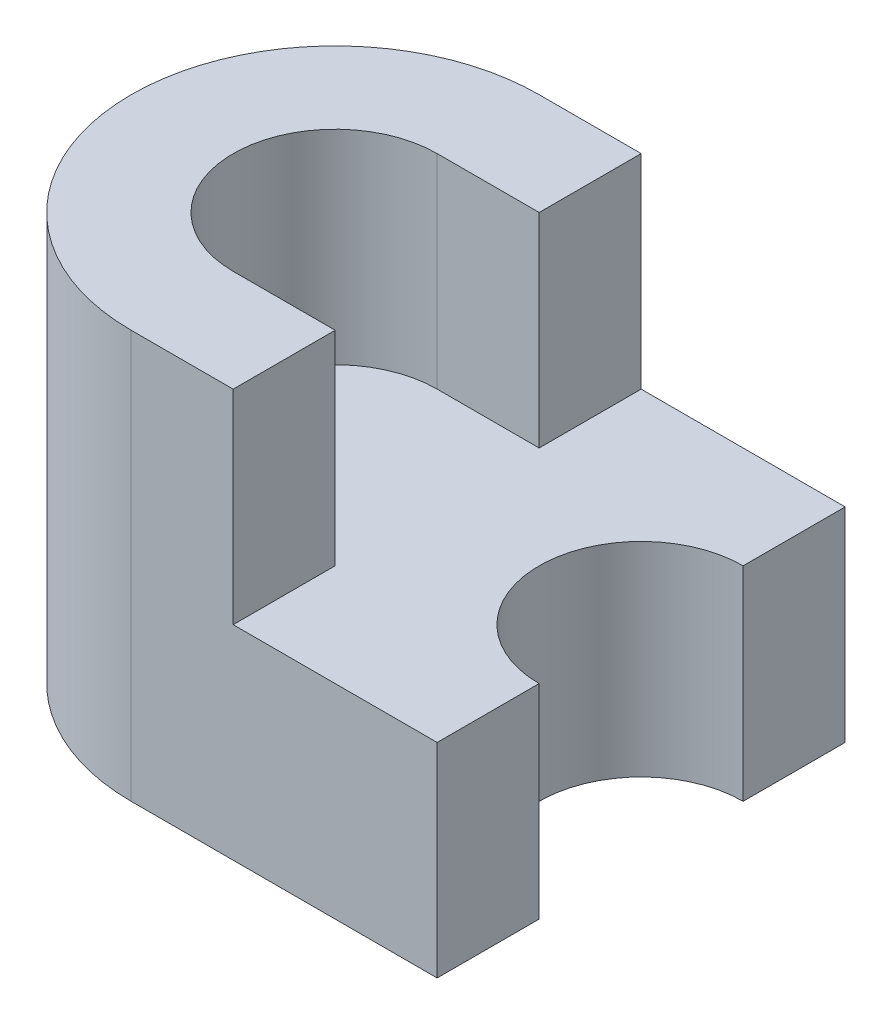
ISO-10303-21;
HEADER;
FILE_DESCRIPTION(('STEP AP214'),'2;1');
FILE_NAME('part.step','',(''),(''),'','','');
FILE_SCHEMA(('AUTOMOTIVE_DESIGN { 1 0 10303 214 1 1 1 1 }'));
ENDSEC;
DATA;
#1=APPLICATION_CONTEXT('core data for automotive mechanical design processes');
#2=APPLICATION_PROTOCOL_DEFINITION('international standard','automotive_design',2000,#1);
#3=PRODUCT_CONTEXT('',#1,'mechanical');
#4=PRODUCT('Part','Part','',(#3));
#5=PRODUCT_RELATED_PRODUCT_CATEGORY('part','',(#4));
#6=PRODUCT_DEFINITION_FORMATION('','',#4);
#7=PRODUCT_DEFINITION_CONTEXT('part definition',#1,'design');
#8=PRODUCT_DEFINITION('design','',#6,#7);
#9=PRODUCT_DEFINITION_SHAPE('','',#8);
#10=(LENGTH_UNIT() NAMED_UNIT(*) SI_UNIT(.MILLI.,.METRE.));
#11=(NAMED_UNIT(*) PLANE_ANGLE_UNIT() SI_UNIT($,.RADIAN.));
#12=(NAMED_UNIT(*) SI_UNIT($,.STERADIAN.) SOLID_ANGLE_UNIT());
#13=UNCERTAINTY_MEASURE_WITH_UNIT(LENGTH_MEASURE(1.E-05),#10,'distance_accuracy_value','');
#14=(GEOMETRIC_REPRESENTATION_CONTEXT(3) GLOBAL_UNCERTAINTY_ASSIGNED_CONTEXT((#13)) GLOBAL_UNIT_ASSIGNED_CONTEXT((#10,
#11,#12)) REPRESENTATION_CONTEXT('',''));
#15=CARTESIAN_POINT('',(0.,0.,0.));
#16=DIRECTION('',(0.,0.,1.));
#17=DIRECTION('',(1.,0.,0.));
#18=AXIS2_PLACEMENT_3D('',#15,#16,#17);
#19=CARTESIAN_POINT('',(0.,40.,0.));
#20=DIRECTION('',(0.,-1.,0.));
#21=DIRECTION('',(0.,0.,-1.));
#22=AXIS2_PLACEMENT_3D('',#19,#20,#21);
#23=PLANE('',#22);
#24=DIRECTION('',(-1.,0.,0.));
#25=VECTOR('',#24,1.);
#26=CARTESIAN_POINT('',(0.,40.,-40.));
#27=LINE('',#26,#25);
#28=CARTESIAN_POINT('',(30.0022520563151,40.,-40.));
#29=VERTEX_POINT('',#28);
#30=CARTESIAN_POINT('',(20.,40.,-40.));
#31=VERTEX_POINT('',#30);
#32=EDGE_CURVE('E224',#29,#31,#27,.T.);
#33=ORIENTED_EDGE('',*,*,#32,.T.);
#34=CARTESIAN_POINT('',(20.,40.,-20.));
#35=DIRECTION('',(0.,-1.,0.));
#36=DIRECTION('',(0.,0.,-1.));
#37=AXIS2_PLACEMENT_3D('',#34,#35,#36);
#38=CIRCLE('',#37,20.);
#39=CARTESIAN_POINT('',(0.,40.,-20.));
#40=VERTEX_POINT('',#39);
#41=EDGE_CURVE('E55',#31,#40,#38,.F.);
#42=ORIENTED_EDGE('',*,*,#41,.T.);
#43=CARTESIAN_POINT('',(20.,40.,-20.));
#44=DIRECTION('',(0.,-1.,0.));
#45=DIRECTION('',(0.,0.,-1.));
#46=AXIS2_PLACEMENT_3D('',#43,#44,#45);
#47=CIRCLE('',#46,20.);
#48=CARTESIAN_POINT('',(20.,40.,0.));
#49=VERTEX_POINT('',#48);
#50=EDGE_CURVE('E62',#40,#49,#47,.F.);
#51=ORIENTED_EDGE('',*,*,#50,.T.);
#52=DIRECTION('',(1.,0.,0.));
#53=VECTOR('',#52,1.);
#54=CARTESIAN_POINT('',(0.,40.,0.));
#55=LINE('',#54,#53);
#56=CARTESIAN_POINT('',(30.0022520563151,40.,0.));
#57=VERTEX_POINT('',#56);
#58=EDGE_CURVE('E227',#49,#57,#55,.T.);
#59=ORIENTED_EDGE('',*,*,#58,.T.);
#60=DIRECTION('',(0.,0.,1.));
#61=VECTOR('',#60,1.);
#62=CARTESIAN_POINT('',(30.0022520563151,40.,-40.));
#63=LINE('',#62,#61);
#64=CARTESIAN_POINT('',(30.0022520563151,40.,-10.));
#65=VERTEX_POINT('',#64);
#66=EDGE_CURVE('E143',#65,#57,#63,.T.);
#67=ORIENTED_EDGE('',*,*,#66,.F.);
#68=DIRECTION('',(1.,0.,0.));
#69=VECTOR('',#68,1.);
#70=CARTESIAN_POINT('',(20.0022520563151,40.,-10.));
#71=LINE('',#70,#69);
#72=CARTESIAN_POINT('',(20.0022520563151,40.,-10.));
#73=VERTEX_POINT('',#72);
#74=EDGE_CURVE('E136',#73,#65,#71,.T.);
#75=ORIENTED_EDGE('',*,*,#74,.F.);
#76=CARTESIAN_POINT('',(20.0022520563151,40.,-20.));
#77=DIRECTION('',(0.,-1.,0.));
#78=DIRECTION('',(0.,0.,-1.));
#79=AXIS2_PLACEMENT_3D('',#76,#77,#78);
#80=CIRCLE('',#79,10.);
#81=CARTESIAN_POINT('',(20.0022520563151,40.,-30.));
#82=VERTEX_POINT('',#81);
#83=EDGE_CURVE('E140',#82,#73,#80,.F.);
#84=ORIENTED_EDGE('',*,*,#83,.F.);
#85=DIRECTION('',(-1.,0.,0.));
#86=VECTOR('',#85,1.);
#87=CARTESIAN_POINT('',(20.0022520563151,40.,-30.));
#88=LINE('',#87,#86);
#89=CARTESIAN_POINT('',(30.0022520563151,40.,-30.));
#90=VERTEX_POINT('',#89);
#91=EDGE_CURVE('E148',#90,#82,#88,.T.);
#92=ORIENTED_EDGE('',*,*,#91,.F.);
#93=EDGE_CURVE('E203',#29,#90,#63,.T.);
#94=ORIENTED_EDGE('',*,*,#93,.F.);
#95=EDGE_LOOP('',(#33,#42,#51,#59,#67,#75,#84,#92,#94));
#96=FACE_BOUND('',#95,.T.);
#97=ADVANCED_FACE('F45',(#96),#23,.F.);
#98=CARTESIAN_POINT('',(30.0022520563151,20.,-40.));
#99=DIRECTION('',(-1.,0.,0.));
#100=DIRECTION('',(0.,0.,1.));
#101=AXIS2_PLACEMENT_3D('',#98,#99,#100);
#102=PLANE('',#101);
#103=ORIENTED_EDGE('',*,*,#93,.T.);
#104=DIRECTION('',(0.,1.,0.));
#105=VECTOR('',#104,1.);
#106=CARTESIAN_POINT('',(30.0022520563151,20.,-30.));
#107=LINE('',#106,#105);
#108=CARTESIAN_POINT('',(30.0022520563151,20.,-30.));
#109=VERTEX_POINT('',#108);
#110=EDGE_CURVE('E181',#109,#90,#107,.T.);
#111=ORIENTED_EDGE('',*,*,#110,.F.);
#112=DIRECTION('',(0.,0.,1.));
#113=VECTOR('',#112,1.);
#114=CARTESIAN_POINT('',(30.0022520563151,20.,-40.));
#115=LINE('',#114,#113);
#116=CARTESIAN_POINT('',(30.0022520563151,20.,-40.));
#117=VERTEX_POINT('',#116);
#118=EDGE_CURVE('E195',#117,#109,#115,.T.);
#119=ORIENTED_EDGE('',*,*,#118,.F.);
#120=DIRECTION('',(0.,1.,0.));
#121=VECTOR('',#120,1.);
#122=CARTESIAN_POINT('',(30.0022520563151,20.,-40.));
#123=LINE('',#122,#121);
#124=EDGE_CURVE('E202',#117,#29,#123,.T.);
#125=ORIENTED_EDGE('',*,*,#124,.T.);
#126=EDGE_LOOP('',(#103,#111,#119,#125));
#127=FACE_BOUND('',#126,.T.);
#128=ADVANCED_FACE('F306',(#127),#102,.F.);
#129=CARTESIAN_POINT('',(50.,40.,0.));
#130=DIRECTION('',(-1.,0.,0.));
#131=DIRECTION('',(0.,0.,1.));
#132=AXIS2_PLACEMENT_3D('',#129,#130,#131);
#133=PLANE('',#132);
#134=DIRECTION('',(0.,-1.,0.));
#135=VECTOR('',#134,1.);
#136=CARTESIAN_POINT('',(50.,40.,-40.));
#137=LINE('',#136,#135);
#138=CARTESIAN_POINT('',(50.,20.,-40.));
#139=VERTEX_POINT('',#138);
#140=CARTESIAN_POINT('',(50.,0.,-40.));
#141=VERTEX_POINT('',#140);
#142=EDGE_CURVE('E245',#139,#141,#137,.T.);
#143=ORIENTED_EDGE('',*,*,#142,.F.);
#144=DIRECTION('',(0.,0.,-1.));
#145=VECTOR('',#144,1.);
#146=CARTESIAN_POINT('',(50.,20.,-40.));
#147=LINE('',#146,#145);
#148=CARTESIAN_POINT('',(50.,20.,-30.));
#149=VERTEX_POINT('',#148);
#150=EDGE_CURVE('E190',#149,#139,#147,.T.);
#151=ORIENTED_EDGE('',*,*,#150,.F.);
#152=DIRECTION('',(0.,-1.,0.));
#153=VECTOR('',#152,1.);
#154=CARTESIAN_POINT('',(50.,40.,-30.));
#155=LINE('',#154,#153);
#156=CARTESIAN_POINT('',(50.,0.,-30.));
#157=VERTEX_POINT('',#156);
#158=EDGE_CURVE('E217',#149,#157,#155,.T.);
#159=ORIENTED_EDGE('',*,*,#158,.T.);
#160=DIRECTION('',(0.,0.,-1.));
#161=VECTOR('',#160,1.);
#162=CARTESIAN_POINT('',(50.,0.,0.));
#163=LINE('',#162,#161);
#164=EDGE_CURVE('E221',#157,#141,#163,.T.);
#165=ORIENTED_EDGE('',*,*,#164,.T.);
#166=EDGE_LOOP('',(#143,#151,#159,#165));
#167=FACE_BOUND('',#166,.T.);
#168=ADVANCED_FACE('F297',(#167),#133,.F.);
#169=DIRECTION('',(0.,-1.,0.));
#170=VECTOR('',#169,1.);
#171=CARTESIAN_POINT('',(50.,40.,-10.));
#172=LINE('',#171,#170);
#173=CARTESIAN_POINT('',(50.,20.,-10.));
#174=VERTEX_POINT('',#173);
#175=CARTESIAN_POINT('',(50.,0.,-10.));
#176=VERTEX_POINT('',#175);
#177=EDGE_CURVE('E218',#174,#176,#172,.T.);
#178=ORIENTED_EDGE('',*,*,#177,.F.);
#179=CARTESIAN_POINT('',(50.,20.,0.));
#180=VERTEX_POINT('',#179);
#181=EDGE_CURVE('E186',#180,#174,#147,.T.);
#182=ORIENTED_EDGE('',*,*,#181,.F.);
#183=DIRECTION('',(0.,-1.,0.));
#184=VECTOR('',#183,1.);
#185=CARTESIAN_POINT('',(50.,40.,0.));
#186=LINE('',#185,#184);
#187=CARTESIAN_POINT('',(50.,0.,0.));
#188=VERTEX_POINT('',#187);
#189=EDGE_CURVE('E231',#180,#188,#186,.T.);
#190=ORIENTED_EDGE('',*,*,#189,.T.);
#191=EDGE_CURVE('E232',#188,#176,#163,.T.);
#192=ORIENTED_EDGE('',*,*,#191,.T.);
#193=EDGE_LOOP('',(#178,#182,#190,#192));
#194=FACE_BOUND('',#193,.T.);
#195=ADVANCED_FACE('F284',(#194),#133,.F.);
#196=CARTESIAN_POINT('',(0.,40.,-40.));
#197=DIRECTION('',(0.,0.,1.));
#198=DIRECTION('',(1.,0.,0.));
#199=AXIS2_PLACEMENT_3D('',#196,#197,#198);
#200=PLANE('',#199);
#201=DIRECTION('',(-1.,0.,0.));
#202=VECTOR('',#201,1.);
#203=CARTESIAN_POINT('',(0.,0.,-40.));
#204=LINE('',#203,#202);
#205=CARTESIAN_POINT('',(20.,0.,-40.));
#206=VERTEX_POINT('',#205);
#207=EDGE_CURVE('E236',#141,#206,#204,.T.);
#208=ORIENTED_EDGE('',*,*,#207,.T.);
#209=DIRECTION('',(0.,-1.,0.));
#210=VECTOR('',#209,1.);
#211=CARTESIAN_POINT('',(20.,40.,-40.));
#212=LINE('',#211,#210);
#213=EDGE_CURVE('E258',#206,#31,#212,.F.);
#214=ORIENTED_EDGE('',*,*,#213,.T.);
#215=ORIENTED_EDGE('',*,*,#32,.F.);
#216=ORIENTED_EDGE('',*,*,#124,.F.);
#217=DIRECTION('',(-1.,0.,0.));
#218=VECTOR('',#217,1.);
#219=CARTESIAN_POINT('',(50.,20.,-40.));
#220=LINE('',#219,#218);
#221=EDGE_CURVE('E189',#139,#117,#220,.T.);
#222=ORIENTED_EDGE('',*,*,#221,.F.);
#223=ORIENTED_EDGE('',*,*,#142,.T.);
#224=EDGE_LOOP('',(#208,#214,#215,#216,#222,#223));
#225=FACE_BOUND('',#224,.T.);
#226=ADVANCED_FACE('F302',(#225),#200,.F.);
#227=CARTESIAN_POINT('',(0.,40.,0.));
#228=DIRECTION('',(0.,0.,-1.));
#229=DIRECTION('',(-1.,0.,0.));
#230=AXIS2_PLACEMENT_3D('',#227,#228,#229);
#231=PLANE('',#230);
#232=ORIENTED_EDGE('',*,*,#58,.F.);
#233=DIRECTION('',(0.,-1.,0.));
#234=VECTOR('',#233,1.);
#235=CARTESIAN_POINT('',(20.,40.,0.));
#236=LINE('',#235,#234);
#237=CARTESIAN_POINT('',(20.,0.,0.));
#238=VERTEX_POINT('',#237);
#239=EDGE_CURVE('E11',#49,#238,#236,.T.);
#240=ORIENTED_EDGE('',*,*,#239,.T.);
#241=DIRECTION('',(1.,0.,0.));
#242=VECTOR('',#241,1.);
#243=CARTESIAN_POINT('',(0.,0.,0.));
#244=LINE('',#243,#242);
#245=EDGE_CURVE('E228',#238,#188,#244,.T.);
#246=ORIENTED_EDGE('',*,*,#245,.T.);
#247=ORIENTED_EDGE('',*,*,#189,.F.);
#248=DIRECTION('',(1.,0.,0.));
#249=VECTOR('',#248,1.);
#250=CARTESIAN_POINT('',(50.,20.,0.));
#251=LINE('',#250,#249);
#252=CARTESIAN_POINT('',(30.0022520563151,20.,0.));
#253=VERTEX_POINT('',#252);
#254=EDGE_CURVE('E199',#253,#180,#251,.T.);
#255=ORIENTED_EDGE('',*,*,#254,.F.);
#256=DIRECTION('',(0.,1.,0.));
#257=VECTOR('',#256,1.);
#258=CARTESIAN_POINT('',(30.0022520563151,20.,0.));
#259=LINE('',#258,#257);
#260=EDGE_CURVE('E207',#253,#57,#259,.T.);
#261=ORIENTED_EDGE('',*,*,#260,.T.);
#262=EDGE_LOOP('',(#232,#240,#246,#247,#255,#261));
#263=FACE_BOUND('',#262,.T.);
#264=ADVANCED_FACE('F276',(#263),#231,.F.);
#265=CARTESIAN_POINT('',(0.,0.,0.));
#266=DIRECTION('',(0.,-1.,0.));
#267=DIRECTION('',(0.,0.,-1.));
#268=AXIS2_PLACEMENT_3D('',#265,#266,#267);
#269=PLANE('',#268);
#270=CARTESIAN_POINT('',(20.,0.,-20.));
#271=DIRECTION('',(0.,-1.,0.));
#272=DIRECTION('',(0.,0.,-1.));
#273=AXIS2_PLACEMENT_3D('',#270,#271,#272);
#274=CIRCLE('',#273,20.);
#275=CARTESIAN_POINT('',(0.,0.,-20.));
#276=VERTEX_POINT('',#275);
#277=EDGE_CURVE('E252',#238,#276,#274,.T.);
#278=ORIENTED_EDGE('',*,*,#277,.T.);
#279=CARTESIAN_POINT('',(20.,0.,-20.));
#280=DIRECTION('',(0.,-1.,0.));
#281=DIRECTION('',(0.,0.,-1.));
#282=AXIS2_PLACEMENT_3D('',#279,#280,#281);
#283=CIRCLE('',#282,20.);
#284=EDGE_CURVE('E255',#276,#206,#283,.T.);
#285=ORIENTED_EDGE('',*,*,#284,.T.);
#286=ORIENTED_EDGE('',*,*,#207,.F.);
#287=ORIENTED_EDGE('',*,*,#164,.F.);
#288=CARTESIAN_POINT('',(50.,0.,-20.));
#289=DIRECTION('',(0.,-1.,0.));
#290=DIRECTION('',(0.,0.,1.));
#291=AXIS2_PLACEMENT_3D('',#288,#289,#290);
#292=CIRCLE('',#291,10.);
#293=EDGE_CURVE('E211',#176,#157,#292,.T.);
#294=ORIENTED_EDGE('',*,*,#293,.F.);
#295=ORIENTED_EDGE('',*,*,#191,.F.);
#296=ORIENTED_EDGE('',*,*,#245,.F.);
#297=EDGE_LOOP('',(#278,#285,#286,#287,#294,#295,#296));
#298=FACE_BOUND('',#297,.T.);
#299=ADVANCED_FACE('F292',(#298),#269,.T.);
#300=CARTESIAN_POINT('',(50.,40.,-20.));
#301=DIRECTION('',(0.,-1.,0.));
#302=DIRECTION('',(0.,0.,-1.));
#303=AXIS2_PLACEMENT_3D('',#300,#301,#302);
#304=CYLINDRICAL_SURFACE('',#303,10.);
#305=ORIENTED_EDGE('',*,*,#158,.F.);
#306=CARTESIAN_POINT('',(50.,20.,-20.));
#307=DIRECTION('',(0.,-1.,0.));
#308=DIRECTION('',(0.,0.,-1.));
#309=AXIS2_PLACEMENT_3D('',#306,#307,#308);
#310=CIRCLE('',#309,10.);
#311=EDGE_CURVE('E248',#149,#174,#310,.F.);
#312=ORIENTED_EDGE('',*,*,#311,.T.);
#313=ORIENTED_EDGE('',*,*,#177,.T.);
#314=ORIENTED_EDGE('',*,*,#293,.T.);
#315=EDGE_LOOP('',(#305,#312,#313,#314));
#316=FACE_BOUND('',#315,.T.);
#317=ADVANCED_FACE('F289',(#316),#304,.F.);
#318=CARTESIAN_POINT('',(0.,20.,0.));
#319=DIRECTION('',(0.,-1.,0.));
#320=DIRECTION('',(0.,0.,-1.));
#321=AXIS2_PLACEMENT_3D('',#318,#319,#320);
#322=PLANE('',#321);
#323=ORIENTED_EDGE('',*,*,#150,.T.);
#324=ORIENTED_EDGE('',*,*,#221,.T.);
#325=ORIENTED_EDGE('',*,*,#118,.T.);
#326=DIRECTION('',(-1.,0.,0.));
#327=VECTOR('',#326,1.);
#328=CARTESIAN_POINT('',(20.0022520563151,20.,-30.));
#329=LINE('',#328,#327);
#330=CARTESIAN_POINT('',(20.0022520563151,20.,-30.));
#331=VERTEX_POINT('',#330);
#332=EDGE_CURVE('E160',#109,#331,#329,.T.);
#333=ORIENTED_EDGE('',*,*,#332,.T.);
#334=CARTESIAN_POINT('',(20.0022520563151,20.,-20.));
#335=DIRECTION('',(0.,-1.,0.));
#336=DIRECTION('',(0.,0.,-1.));
#337=AXIS2_PLACEMENT_3D('',#334,#335,#336);
#338=CIRCLE('',#337,10.);
#339=CARTESIAN_POINT('',(20.0022520563151,20.,-10.));
#340=VERTEX_POINT('',#339);
#341=EDGE_CURVE('E149',#331,#340,#338,.F.);
#342=ORIENTED_EDGE('',*,*,#341,.T.);
#343=DIRECTION('',(1.,0.,0.));
#344=VECTOR('',#343,1.);
#345=CARTESIAN_POINT('',(20.0022520563151,20.,-10.));
#346=LINE('',#345,#344);
#347=CARTESIAN_POINT('',(30.0022520563151,20.,-10.));
#348=VERTEX_POINT('',#347);
#349=EDGE_CURVE('E154',#340,#348,#346,.T.);
#350=ORIENTED_EDGE('',*,*,#349,.T.);
#351=EDGE_CURVE('E194',#348,#253,#115,.T.);
#352=ORIENTED_EDGE('',*,*,#351,.T.);
#353=ORIENTED_EDGE('',*,*,#254,.T.);
#354=ORIENTED_EDGE('',*,*,#181,.T.);
#355=ORIENTED_EDGE('',*,*,#311,.F.);
#356=EDGE_LOOP('',(#323,#324,#325,#333,#342,#350,#352,#353,#354,#355));
#357=FACE_BOUND('',#356,.T.);
#358=ADVANCED_FACE('F281',(#357),#322,.F.);
#359=ORIENTED_EDGE('',*,*,#351,.F.);
#360=DIRECTION('',(0.,1.,0.));
#361=VECTOR('',#360,1.);
#362=CARTESIAN_POINT('',(30.0022520563151,20.,-10.));
#363=LINE('',#362,#361);
#364=EDGE_CURVE('E159',#348,#65,#363,.T.);
#365=ORIENTED_EDGE('',*,*,#364,.T.);
#366=ORIENTED_EDGE('',*,*,#66,.T.);
#367=ORIENTED_EDGE('',*,*,#260,.F.);
#368=EDGE_LOOP('',(#359,#365,#366,#367));
#369=FACE_BOUND('',#368,.T.);
#370=ADVANCED_FACE('F273',(#369),#102,.F.);
#371=CARTESIAN_POINT('',(20.0022520563151,20.,-30.));
#372=DIRECTION('',(0.,0.,-1.));
#373=DIRECTION('',(-1.,0.,0.));
#374=AXIS2_PLACEMENT_3D('',#371,#372,#373);
#375=PLANE('',#374);
#376=ORIENTED_EDGE('',*,*,#91,.T.);
#377=DIRECTION('',(0.,1.,0.));
#378=VECTOR('',#377,1.);
#379=CARTESIAN_POINT('',(20.0022520563151,20.,-30.));
#380=LINE('',#379,#378);
#381=EDGE_CURVE('E164',#331,#82,#380,.T.);
#382=ORIENTED_EDGE('',*,*,#381,.F.);
#383=ORIENTED_EDGE('',*,*,#332,.F.);
#384=ORIENTED_EDGE('',*,*,#110,.T.);
#385=EDGE_LOOP('',(#376,#382,#383,#384));
#386=FACE_BOUND('',#385,.T.);
#387=ADVANCED_FACE('F309',(#386),#375,.F.);
#388=CARTESIAN_POINT('',(20.0022520563151,20.,-10.));
#389=DIRECTION('',(0.,0.,1.));
#390=DIRECTION('',(1.,0.,0.));
#391=AXIS2_PLACEMENT_3D('',#388,#389,#390);
#392=PLANE('',#391);
#393=ORIENTED_EDGE('',*,*,#74,.T.);
#394=ORIENTED_EDGE('',*,*,#364,.F.);
#395=ORIENTED_EDGE('',*,*,#349,.F.);
#396=DIRECTION('',(0.,1.,0.));
#397=VECTOR('',#396,1.);
#398=CARTESIAN_POINT('',(20.0022520563151,20.,-10.));
#399=LINE('',#398,#397);
#400=EDGE_CURVE('E152',#340,#73,#399,.T.);
#401=ORIENTED_EDGE('',*,*,#400,.T.);
#402=EDGE_LOOP('',(#393,#394,#395,#401));
#403=FACE_BOUND('',#402,.T.);
#404=ADVANCED_FACE('F153',(#403),#392,.F.);
#405=CARTESIAN_POINT('',(20.0022520563151,134.372930440884,-20.));
#406=DIRECTION('',(0.,-1.,0.));
#407=DIRECTION('',(0.,0.,-1.));
#408=AXIS2_PLACEMENT_3D('',#405,#406,#407);
#409=CYLINDRICAL_SURFACE('',#408,10.);
#410=ORIENTED_EDGE('',*,*,#83,.T.);
#411=ORIENTED_EDGE('',*,*,#400,.F.);
#412=ORIENTED_EDGE('',*,*,#341,.F.);
#413=ORIENTED_EDGE('',*,*,#381,.T.);
#414=EDGE_LOOP('',(#410,#411,#412,#413));
#415=FACE_BOUND('',#414,.T.);
#416=ADVANCED_FACE('F163',(#415),#409,.F.);
#417=CARTESIAN_POINT('',(20.,40.,-20.));
#418=DIRECTION('',(0.,-1.,0.));
#419=DIRECTION('',(0.,0.,-1.));
#420=AXIS2_PLACEMENT_3D('',#417,#418,#419);
#421=CYLINDRICAL_SURFACE('',#420,20.);
#422=ORIENTED_EDGE('',*,*,#239,.F.);
#423=ORIENTED_EDGE('',*,*,#50,.F.);
#424=DIRECTION('',(0.,-1.,0.));
#425=VECTOR('',#424,1.);
#426=CARTESIAN_POINT('',(0.,40.,-20.));
#427=LINE('',#426,#425);
#428=EDGE_CURVE('E49',#276,#40,#427,.F.);
#429=ORIENTED_EDGE('',*,*,#428,.F.);
#430=ORIENTED_EDGE('',*,*,#277,.F.);
#431=EDGE_LOOP('',(#422,#423,#429,#430));
#432=FACE_BOUND('',#431,.T.);
#433=ADVANCED_FACE('F47',(#432),#421,.T.);
#434=CARTESIAN_POINT('',(20.,40.,-20.));
#435=DIRECTION('',(0.,-1.,0.));
#436=DIRECTION('',(0.,0.,-1.));
#437=AXIS2_PLACEMENT_3D('',#434,#435,#436);
#438=CYLINDRICAL_SURFACE('',#437,20.);
#439=ORIENTED_EDGE('',*,*,#41,.F.);
#440=ORIENTED_EDGE('',*,*,#213,.F.);
#441=ORIENTED_EDGE('',*,*,#284,.F.);
#442=ORIENTED_EDGE('',*,*,#428,.T.);
#443=EDGE_LOOP('',(#439,#440,#441,#442));
#444=FACE_BOUND('',#443,.T.);
#445=ADVANCED_FACE('F333',(#444),#438,.T.);
#446=CLOSED_SHELL('',(#97,#128,#168,#195,#226,#264,#299,#317,#358,#370,#387,#404,#416,#433,#445));
#447=MANIFOLD_SOLID_BREP('B2',#446);
#448=ADVANCED_BREP_SHAPE_REPRESENTATION('',(#18,#447),#14);
#449=SHAPE_DEFINITION_REPRESENTATION(#9,#448);
ENDSEC;
END-ISO-10303-21;
